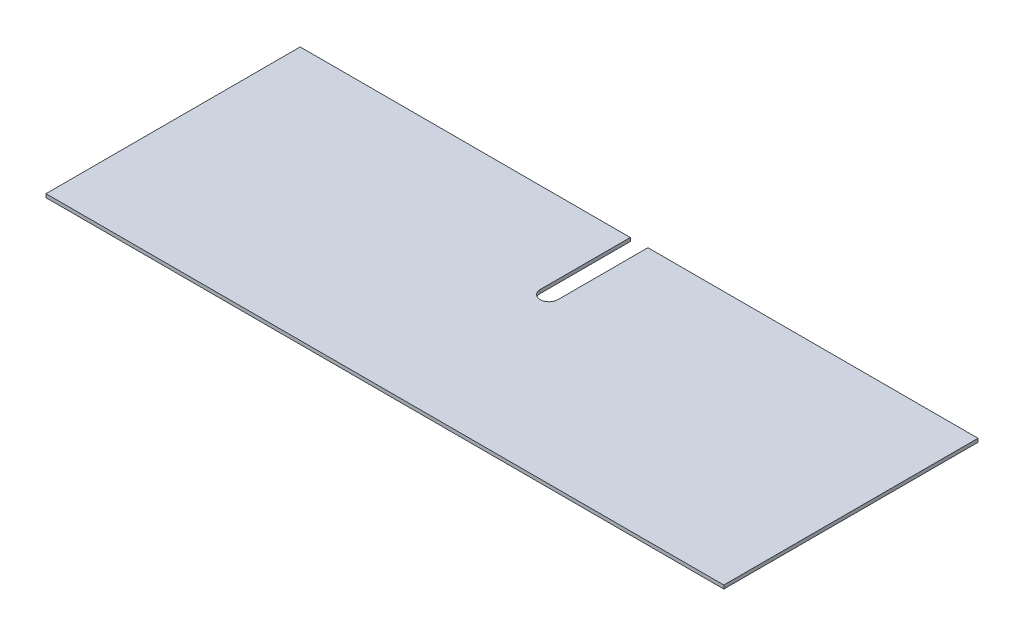
ISO-10303-21;
HEADER;
FILE_DESCRIPTION(('STEP AP214'),'2;1');
FILE_NAME('part.step','',(''),(''),'','','');
FILE_SCHEMA(('AUTOMOTIVE_DESIGN { 1 0 10303 214 1 1 1 1 }'));
ENDSEC;
DATA;
#1=APPLICATION_CONTEXT('core data for automotive mechanical design processes');
#2=APPLICATION_PROTOCOL_DEFINITION('international standard','automotive_design',2000,#1);
#3=PRODUCT_CONTEXT('',#1,'mechanical');
#4=PRODUCT('Part','Part','',(#3));
#5=PRODUCT_RELATED_PRODUCT_CATEGORY('part','',(#4));
#6=PRODUCT_DEFINITION_FORMATION('','',#4);
#7=PRODUCT_DEFINITION_CONTEXT('part definition',#1,'design');
#8=PRODUCT_DEFINITION('design','',#6,#7);
#9=PRODUCT_DEFINITION_SHAPE('','',#8);
#10=(LENGTH_UNIT() NAMED_UNIT(*) SI_UNIT(.MILLI.,.METRE.));
#11=(NAMED_UNIT(*) PLANE_ANGLE_UNIT() SI_UNIT($,.RADIAN.));
#12=(NAMED_UNIT(*) SI_UNIT($,.STERADIAN.) SOLID_ANGLE_UNIT());
#13=UNCERTAINTY_MEASURE_WITH_UNIT(LENGTH_MEASURE(1.E-05),#10,'distance_accuracy_value','');
#14=(GEOMETRIC_REPRESENTATION_CONTEXT(3) GLOBAL_UNCERTAINTY_ASSIGNED_CONTEXT((#13)) GLOBAL_UNIT_ASSIGNED_CONTEXT((#10,
#11,#12)) REPRESENTATION_CONTEXT('',''));
#15=CARTESIAN_POINT('',(0.,0.,0.));
#16=DIRECTION('',(0.,0.,1.));
#17=DIRECTION('',(1.,0.,0.));
#18=AXIS2_PLACEMENT_3D('',#15,#16,#17);
#19=CARTESIAN_POINT('',(0.,3.175,-228.6));
#20=DIRECTION('',(0.,0.,1.));
#21=DIRECTION('',(1.,0.,0.));
#22=AXIS2_PLACEMENT_3D('',#19,#20,#21);
#23=PLANE('',#22);
#24=DIRECTION('',(-1.,0.,0.));
#25=VECTOR('',#24,1.);
#26=CARTESIAN_POINT('',(0.,3.175,-228.6));
#27=LINE('',#26,#25);
#28=CARTESIAN_POINT('',(296.8625,3.175,-228.6));
#29=VERTEX_POINT('',#28);
#30=CARTESIAN_POINT('',(0.,3.175,-228.6));
#31=VERTEX_POINT('',#30);
#32=EDGE_CURVE('E61',#29,#31,#27,.T.);
#33=ORIENTED_EDGE('',*,*,#32,.F.);
#34=DIRECTION('',(0.,1.,0.));
#35=VECTOR('',#34,1.);
#36=CARTESIAN_POINT('',(296.8625,0.,-228.6));
#37=LINE('',#36,#35);
#38=CARTESIAN_POINT('',(296.8625,0.,-228.6));
#39=VERTEX_POINT('',#38);
#40=EDGE_CURVE('E137',#39,#29,#37,.T.);
#41=ORIENTED_EDGE('',*,*,#40,.F.);
#42=DIRECTION('',(-1.,0.,0.));
#43=VECTOR('',#42,1.);
#44=CARTESIAN_POINT('',(0.,0.,-228.6));
#45=LINE('',#44,#43);
#46=CARTESIAN_POINT('',(0.,0.,-228.6));
#47=VERTEX_POINT('',#46);
#48=EDGE_CURVE('E83',#39,#47,#45,.T.);
#49=ORIENTED_EDGE('',*,*,#48,.T.);
#50=DIRECTION('',(0.,-1.,0.));
#51=VECTOR('',#50,1.);
#52=CARTESIAN_POINT('',(0.,3.175,-228.6));
#53=LINE('',#52,#51);
#54=EDGE_CURVE('E153',#31,#47,#53,.T.);
#55=ORIENTED_EDGE('',*,*,#54,.F.);
#56=EDGE_LOOP('',(#33,#41,#49,#55));
#57=FACE_BOUND('',#56,.T.);
#58=ADVANCED_FACE('F37',(#57),#23,.F.);
#59=CARTESIAN_POINT('',(0.,3.175,0.));
#60=DIRECTION('',(1.,0.,0.));
#61=DIRECTION('',(0.,0.,-1.));
#62=AXIS2_PLACEMENT_3D('',#59,#60,#61);
#63=PLANE('',#62);
#64=DIRECTION('',(0.,0.,1.));
#65=VECTOR('',#64,1.);
#66=CARTESIAN_POINT('',(0.,0.,0.));
#67=LINE('',#66,#65);
#68=CARTESIAN_POINT('',(0.,0.,0.));
#69=VERTEX_POINT('',#68);
#70=EDGE_CURVE('E139',#47,#69,#67,.T.);
#71=ORIENTED_EDGE('',*,*,#70,.T.);
#72=DIRECTION('',(0.,-1.,0.));
#73=VECTOR('',#72,1.);
#74=CARTESIAN_POINT('',(0.,3.175,0.));
#75=LINE('',#74,#73);
#76=CARTESIAN_POINT('',(0.,3.175,0.));
#77=VERTEX_POINT('',#76);
#78=EDGE_CURVE('E11',#77,#69,#75,.T.);
#79=ORIENTED_EDGE('',*,*,#78,.F.);
#80=DIRECTION('',(0.,0.,1.));
#81=VECTOR('',#80,1.);
#82=CARTESIAN_POINT('',(0.,3.175,0.));
#83=LINE('',#82,#81);
#84=EDGE_CURVE('E144',#31,#77,#83,.T.);
#85=ORIENTED_EDGE('',*,*,#84,.F.);
#86=ORIENTED_EDGE('',*,*,#54,.T.);
#87=EDGE_LOOP('',(#71,#79,#85,#86));
#88=FACE_BOUND('',#87,.T.);
#89=ADVANCED_FACE('F39',(#88),#63,.F.);
#90=CARTESIAN_POINT('',(0.,3.175,0.));
#91=DIRECTION('',(0.,0.,-1.));
#92=DIRECTION('',(-1.,0.,0.));
#93=AXIS2_PLACEMENT_3D('',#90,#91,#92);
#94=PLANE('',#93);
#95=DIRECTION('',(1.,0.,0.));
#96=VECTOR('',#95,1.);
#97=CARTESIAN_POINT('',(0.,0.,0.));
#98=LINE('',#97,#96);
#99=CARTESIAN_POINT('',(609.6,0.,0.));
#100=VERTEX_POINT('',#99);
#101=EDGE_CURVE('E156',#69,#100,#98,.T.);
#102=ORIENTED_EDGE('',*,*,#101,.T.);
#103=DIRECTION('',(0.,-1.,0.));
#104=VECTOR('',#103,1.);
#105=CARTESIAN_POINT('',(609.6,3.175,0.));
#106=LINE('',#105,#104);
#107=CARTESIAN_POINT('',(609.6,3.175,0.));
#108=VERTEX_POINT('',#107);
#109=EDGE_CURVE('E45',#108,#100,#106,.T.);
#110=ORIENTED_EDGE('',*,*,#109,.F.);
#111=DIRECTION('',(1.,0.,0.));
#112=VECTOR('',#111,1.);
#113=CARTESIAN_POINT('',(0.,3.175,0.));
#114=LINE('',#113,#112);
#115=EDGE_CURVE('E90',#77,#108,#114,.T.);
#116=ORIENTED_EDGE('',*,*,#115,.F.);
#117=ORIENTED_EDGE('',*,*,#78,.T.);
#118=EDGE_LOOP('',(#102,#110,#116,#117));
#119=FACE_BOUND('',#118,.T.);
#120=ADVANCED_FACE('F180',(#119),#94,.F.);
#121=CARTESIAN_POINT('',(609.6,3.175,0.));
#122=DIRECTION('',(-1.,0.,0.));
#123=DIRECTION('',(0.,0.,1.));
#124=AXIS2_PLACEMENT_3D('',#121,#122,#123);
#125=PLANE('',#124);
#126=DIRECTION('',(0.,0.,-1.));
#127=VECTOR('',#126,1.);
#128=CARTESIAN_POINT('',(609.6,0.,0.));
#129=LINE('',#128,#127);
#130=CARTESIAN_POINT('',(609.6,0.,-228.6));
#131=VERTEX_POINT('',#130);
#132=EDGE_CURVE('E158',#100,#131,#129,.T.);
#133=ORIENTED_EDGE('',*,*,#132,.T.);
#134=DIRECTION('',(0.,-1.,0.));
#135=VECTOR('',#134,1.);
#136=CARTESIAN_POINT('',(609.6,3.175,-228.6));
#137=LINE('',#136,#135);
#138=CARTESIAN_POINT('',(609.6,3.175,-228.6));
#139=VERTEX_POINT('',#138);
#140=EDGE_CURVE('E163',#139,#131,#137,.T.);
#141=ORIENTED_EDGE('',*,*,#140,.F.);
#142=DIRECTION('',(0.,0.,-1.));
#143=VECTOR('',#142,1.);
#144=CARTESIAN_POINT('',(609.6,3.175,0.));
#145=LINE('',#144,#143);
#146=EDGE_CURVE('E148',#108,#139,#145,.T.);
#147=ORIENTED_EDGE('',*,*,#146,.F.);
#148=ORIENTED_EDGE('',*,*,#109,.T.);
#149=EDGE_LOOP('',(#133,#141,#147,#148));
#150=FACE_BOUND('',#149,.T.);
#151=ADVANCED_FACE('F169',(#150),#125,.F.);
#152=CARTESIAN_POINT('',(312.7375,0.,-228.6));
#153=VERTEX_POINT('',#152);
#154=EDGE_CURVE('E146',#131,#153,#45,.T.);
#155=ORIENTED_EDGE('',*,*,#154,.T.);
#156=DIRECTION('',(0.,1.,0.));
#157=VECTOR('',#156,1.);
#158=CARTESIAN_POINT('',(312.7375,0.,-228.6));
#159=LINE('',#158,#157);
#160=CARTESIAN_POINT('',(312.7375,3.175,-228.6));
#161=VERTEX_POINT('',#160);
#162=EDGE_CURVE('E140',#153,#161,#159,.T.);
#163=ORIENTED_EDGE('',*,*,#162,.T.);
#164=EDGE_CURVE('E150',#139,#161,#27,.T.);
#165=ORIENTED_EDGE('',*,*,#164,.F.);
#166=ORIENTED_EDGE('',*,*,#140,.T.);
#167=EDGE_LOOP('',(#155,#163,#165,#166));
#168=FACE_BOUND('',#167,.T.);
#169=ADVANCED_FACE('F173',(#168),#23,.F.);
#170=CARTESIAN_POINT('',(0.,3.175,0.));
#171=DIRECTION('',(0.,-1.,0.));
#172=DIRECTION('',(0.,0.,-1.));
#173=AXIS2_PLACEMENT_3D('',#170,#171,#172);
#174=PLANE('',#173);
#175=CARTESIAN_POINT('',(304.8,3.175,-147.6375));
#176=DIRECTION('',(0.,1.,0.));
#177=DIRECTION('',(0.,0.,1.));
#178=AXIS2_PLACEMENT_3D('',#175,#176,#177);
#179=CIRCLE('',#178,7.93750000000004);
#180=CARTESIAN_POINT('',(296.8625,3.175,-147.6375));
#181=VERTEX_POINT('',#180);
#182=CARTESIAN_POINT('',(312.7375,3.175,-147.6375));
#183=VERTEX_POINT('',#182);
#184=EDGE_CURVE('E131',#181,#183,#179,.T.);
#185=ORIENTED_EDGE('',*,*,#184,.F.);
#186=DIRECTION('',(0.,0.,1.));
#187=VECTOR('',#186,1.);
#188=CARTESIAN_POINT('',(296.8625,3.175,-228.6));
#189=LINE('',#188,#187);
#190=EDGE_CURVE('E116',#29,#181,#189,.T.);
#191=ORIENTED_EDGE('',*,*,#190,.F.);
#192=ORIENTED_EDGE('',*,*,#32,.T.);
#193=ORIENTED_EDGE('',*,*,#84,.T.);
#194=ORIENTED_EDGE('',*,*,#115,.T.);
#195=ORIENTED_EDGE('',*,*,#146,.T.);
#196=ORIENTED_EDGE('',*,*,#164,.T.);
#197=DIRECTION('',(0.,0.,-1.));
#198=VECTOR('',#197,1.);
#199=CARTESIAN_POINT('',(312.7375,3.175,-228.6));
#200=LINE('',#199,#198);
#201=EDGE_CURVE('E129',#183,#161,#200,.T.);
#202=ORIENTED_EDGE('',*,*,#201,.F.);
#203=EDGE_LOOP('',(#185,#191,#192,#193,#194,#195,#196,#202));
#204=FACE_BOUND('',#203,.T.);
#205=ADVANCED_FACE('F176',(#204),#174,.F.);
#206=CARTESIAN_POINT('',(0.,0.,0.));
#207=DIRECTION('',(0.,-1.,0.));
#208=DIRECTION('',(0.,0.,-1.));
#209=AXIS2_PLACEMENT_3D('',#206,#207,#208);
#210=PLANE('',#209);
#211=DIRECTION('',(0.,0.,1.));
#212=VECTOR('',#211,1.);
#213=CARTESIAN_POINT('',(296.8625,0.,-228.6));
#214=LINE('',#213,#212);
#215=CARTESIAN_POINT('',(296.8625,0.,-147.6375));
#216=VERTEX_POINT('',#215);
#217=EDGE_CURVE('E115',#39,#216,#214,.T.);
#218=ORIENTED_EDGE('',*,*,#217,.T.);
#219=CARTESIAN_POINT('',(304.8,0.,-147.6375));
#220=DIRECTION('',(0.,1.,0.));
#221=DIRECTION('',(0.,0.,1.));
#222=AXIS2_PLACEMENT_3D('',#219,#220,#221);
#223=CIRCLE('',#222,7.93750000000004);
#224=CARTESIAN_POINT('',(312.7375,0.,-147.6375));
#225=VERTEX_POINT('',#224);
#226=EDGE_CURVE('E123',#216,#225,#223,.T.);
#227=ORIENTED_EDGE('',*,*,#226,.T.);
#228=DIRECTION('',(0.,0.,-1.));
#229=VECTOR('',#228,1.);
#230=CARTESIAN_POINT('',(312.7375,0.,-228.6));
#231=LINE('',#230,#229);
#232=EDGE_CURVE('E52',#225,#153,#231,.T.);
#233=ORIENTED_EDGE('',*,*,#232,.T.);
#234=ORIENTED_EDGE('',*,*,#154,.F.);
#235=ORIENTED_EDGE('',*,*,#132,.F.);
#236=ORIENTED_EDGE('',*,*,#101,.F.);
#237=ORIENTED_EDGE('',*,*,#70,.F.);
#238=ORIENTED_EDGE('',*,*,#48,.F.);
#239=EDGE_LOOP('',(#218,#227,#233,#234,#235,#236,#237,#238));
#240=FACE_BOUND('',#239,.T.);
#241=ADVANCED_FACE('F127',(#240),#210,.T.);
#242=CARTESIAN_POINT('',(296.8625,0.,-228.6));
#243=DIRECTION('',(-1.,0.,0.));
#244=DIRECTION('',(0.,0.,1.));
#245=AXIS2_PLACEMENT_3D('',#242,#243,#244);
#246=PLANE('',#245);
#247=ORIENTED_EDGE('',*,*,#190,.T.);
#248=DIRECTION('',(0.,1.,0.));
#249=VECTOR('',#248,1.);
#250=CARTESIAN_POINT('',(296.8625,0.,-147.6375));
#251=LINE('',#250,#249);
#252=EDGE_CURVE('E111',#216,#181,#251,.T.);
#253=ORIENTED_EDGE('',*,*,#252,.F.);
#254=ORIENTED_EDGE('',*,*,#217,.F.);
#255=ORIENTED_EDGE('',*,*,#40,.T.);
#256=EDGE_LOOP('',(#247,#253,#254,#255));
#257=FACE_BOUND('',#256,.T.);
#258=ADVANCED_FACE('F113',(#257),#246,.F.);
#259=CARTESIAN_POINT('',(312.7375,0.,-228.6));
#260=DIRECTION('',(1.,0.,0.));
#261=DIRECTION('',(0.,0.,-1.));
#262=AXIS2_PLACEMENT_3D('',#259,#260,#261);
#263=PLANE('',#262);
#264=ORIENTED_EDGE('',*,*,#201,.T.);
#265=ORIENTED_EDGE('',*,*,#162,.F.);
#266=ORIENTED_EDGE('',*,*,#232,.F.);
#267=DIRECTION('',(0.,1.,0.));
#268=VECTOR('',#267,1.);
#269=CARTESIAN_POINT('',(312.7375,0.,-147.6375));
#270=LINE('',#269,#268);
#271=EDGE_CURVE('E120',#225,#183,#270,.T.);
#272=ORIENTED_EDGE('',*,*,#271,.T.);
#273=EDGE_LOOP('',(#264,#265,#266,#272));
#274=FACE_BOUND('',#273,.T.);
#275=ADVANCED_FACE('F203',(#274),#263,.F.);
#276=CARTESIAN_POINT('',(304.8,0.,-147.6375));
#277=DIRECTION('',(0.,1.,0.));
#278=DIRECTION('',(0.,0.,1.));
#279=AXIS2_PLACEMENT_3D('',#276,#277,#278);
#280=CYLINDRICAL_SURFACE('',#279,7.93750000000004);
#281=ORIENTED_EDGE('',*,*,#184,.T.);
#282=ORIENTED_EDGE('',*,*,#271,.F.);
#283=ORIENTED_EDGE('',*,*,#226,.F.);
#284=ORIENTED_EDGE('',*,*,#252,.T.);
#285=EDGE_LOOP('',(#281,#282,#283,#284));
#286=FACE_BOUND('',#285,.T.);
#287=ADVANCED_FACE('F124',(#286),#280,.F.);
#288=CLOSED_SHELL('',(#58,#89,#120,#151,#169,#205,#241,#258,#275,#287));
#289=MANIFOLD_SOLID_BREP('B2',#288);
#290=ADVANCED_BREP_SHAPE_REPRESENTATION('',(#18,#289),#14);
#291=SHAPE_DEFINITION_REPRESENTATION(#9,#290);
ENDSEC;
END-ISO-10303-21;
